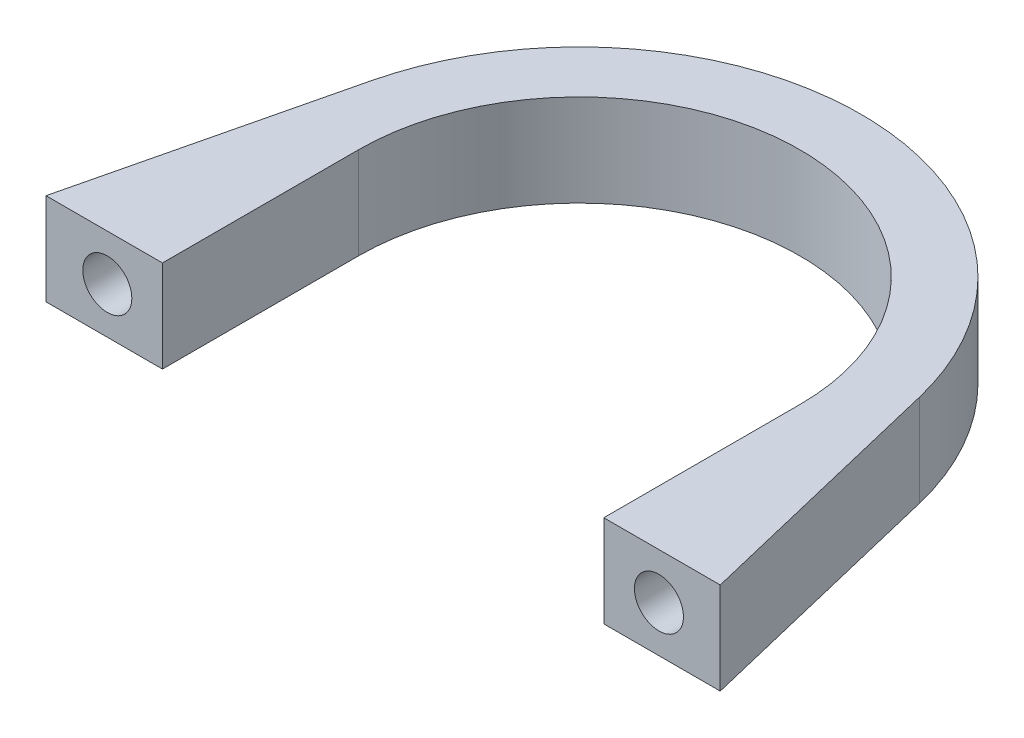
ISO-10303-21;
HEADER;
FILE_DESCRIPTION(('STEP AP214'),'2;1');
FILE_NAME('part.step','',(''),(''),'','','');
FILE_SCHEMA(('AUTOMOTIVE_DESIGN { 1 0 10303 214 1 1 1 1 }'));
ENDSEC;
DATA;
#1=APPLICATION_CONTEXT('core data for automotive mechanical design processes');
#2=APPLICATION_PROTOCOL_DEFINITION('international standard','automotive_design',2000,#1);
#3=PRODUCT_CONTEXT('',#1,'mechanical');
#4=PRODUCT('Part','Part','',(#3));
#5=PRODUCT_RELATED_PRODUCT_CATEGORY('part','',(#4));
#6=PRODUCT_DEFINITION_FORMATION('','',#4);
#7=PRODUCT_DEFINITION_CONTEXT('part definition',#1,'design');
#8=PRODUCT_DEFINITION('design','',#6,#7);
#9=PRODUCT_DEFINITION_SHAPE('','',#8);
#10=(LENGTH_UNIT() NAMED_UNIT(*) SI_UNIT(.MILLI.,.METRE.));
#11=(NAMED_UNIT(*) PLANE_ANGLE_UNIT() SI_UNIT($,.RADIAN.));
#12=(NAMED_UNIT(*) SI_UNIT($,.STERADIAN.) SOLID_ANGLE_UNIT());
#13=UNCERTAINTY_MEASURE_WITH_UNIT(LENGTH_MEASURE(1.E-05),#10,'distance_accuracy_value','');
#14=(GEOMETRIC_REPRESENTATION_CONTEXT(3) GLOBAL_UNCERTAINTY_ASSIGNED_CONTEXT((#13)) GLOBAL_UNIT_ASSIGNED_CONTEXT((#10,
#11,#12)) REPRESENTATION_CONTEXT('',''));
#15=CARTESIAN_POINT('',(0.,0.,0.));
#16=DIRECTION('',(0.,0.,1.));
#17=DIRECTION('',(1.,0.,0.));
#18=AXIS2_PLACEMENT_3D('',#15,#16,#17);
#19=CARTESIAN_POINT('',(-27.5,7.5,16.));
#20=DIRECTION('',(0.,0.,-1.));
#21=DIRECTION('',(-1.,0.,0.));
#22=AXIS2_PLACEMENT_3D('',#19,#20,#21);
#23=PLANE('',#22);
#24=CARTESIAN_POINT('',(-22.5,3.75,16.));
#25=DIRECTION('',(0.,0.,1.));
#26=DIRECTION('',(1.,0.,0.));
#27=AXIS2_PLACEMENT_3D('',#24,#25,#26);
#28=CIRCLE('',#27,2.);
#29=CARTESIAN_POINT('',(-20.5,3.75,16.));
#30=VERTEX_POINT('',#29);
#31=EDGE_CURVE('E221',#30,#30,#28,.T.);
#32=ORIENTED_EDGE('',*,*,#31,.F.);
#33=EDGE_LOOP('',(#32));
#34=FACE_BOUND('',#33,.T.);
#35=DIRECTION('',(1.,0.,0.));
#36=VECTOR('',#35,1.);
#37=CARTESIAN_POINT('',(-27.5,0.,16.));
#38=LINE('',#37,#36);
#39=CARTESIAN_POINT('',(-27.5,0.,16.));
#40=VERTEX_POINT('',#39);
#41=CARTESIAN_POINT('',(-18.,0.,16.));
#42=VERTEX_POINT('',#41);
#43=EDGE_CURVE('E146',#40,#42,#38,.T.);
#44=ORIENTED_EDGE('',*,*,#43,.T.);
#45=DIRECTION('',(0.,-1.,0.));
#46=VECTOR('',#45,1.);
#47=CARTESIAN_POINT('',(-18.,7.5,16.));
#48=LINE('',#47,#46);
#49=CARTESIAN_POINT('',(-18.,7.5,16.));
#50=VERTEX_POINT('',#49);
#51=EDGE_CURVE('E11',#50,#42,#48,.T.);
#52=ORIENTED_EDGE('',*,*,#51,.F.);
#53=DIRECTION('',(1.,0.,0.));
#54=VECTOR('',#53,1.);
#55=CARTESIAN_POINT('',(-27.5,7.5,16.));
#56=LINE('',#55,#54);
#57=CARTESIAN_POINT('',(-27.5,7.5,16.));
#58=VERTEX_POINT('',#57);
#59=EDGE_CURVE('E169',#58,#50,#56,.T.);
#60=ORIENTED_EDGE('',*,*,#59,.F.);
#61=DIRECTION('',(0.,-1.,0.));
#62=VECTOR('',#61,1.);
#63=CARTESIAN_POINT('',(-27.5,7.5,16.));
#64=LINE('',#63,#62);
#65=EDGE_CURVE('E142',#58,#40,#64,.T.);
#66=ORIENTED_EDGE('',*,*,#65,.T.);
#67=EDGE_LOOP('',(#44,#52,#60,#66));
#68=FACE_BOUND('',#67,.T.);
#69=ADVANCED_FACE('F45',(#34,#68),#23,.F.);
#70=CARTESIAN_POINT('',(-18.,7.5,16.));
#71=DIRECTION('',(-1.,0.,0.));
#72=DIRECTION('',(0.,0.,1.));
#73=AXIS2_PLACEMENT_3D('',#70,#71,#72);
#74=PLANE('',#73);
#75=DIRECTION('',(0.,0.,-1.));
#76=VECTOR('',#75,1.);
#77=CARTESIAN_POINT('',(-18.,0.,16.));
#78=LINE('',#77,#76);
#79=CARTESIAN_POINT('',(-18.,0.,0.));
#80=VERTEX_POINT('',#79);
#81=EDGE_CURVE('E150',#42,#80,#78,.T.);
#82=ORIENTED_EDGE('',*,*,#81,.T.);
#83=DIRECTION('',(0.,-1.,0.));
#84=VECTOR('',#83,1.);
#85=CARTESIAN_POINT('',(-18.,7.5,0.));
#86=LINE('',#85,#84);
#87=CARTESIAN_POINT('',(-18.,7.5,0.));
#88=VERTEX_POINT('',#87);
#89=EDGE_CURVE('E54',#88,#80,#86,.T.);
#90=ORIENTED_EDGE('',*,*,#89,.F.);
#91=DIRECTION('',(0.,0.,-1.));
#92=VECTOR('',#91,1.);
#93=CARTESIAN_POINT('',(-18.,7.5,16.));
#94=LINE('',#93,#92);
#95=EDGE_CURVE('E105',#50,#88,#94,.T.);
#96=ORIENTED_EDGE('',*,*,#95,.F.);
#97=ORIENTED_EDGE('',*,*,#51,.T.);
#98=EDGE_LOOP('',(#82,#90,#96,#97));
#99=FACE_BOUND('',#98,.T.);
#100=ADVANCED_FACE('F240',(#99),#74,.F.);
#101=CARTESIAN_POINT('',(0.,7.5,0.));
#102=DIRECTION('',(0.,-1.,0.));
#103=DIRECTION('',(0.,0.,-1.));
#104=AXIS2_PLACEMENT_3D('',#101,#102,#103);
#105=CYLINDRICAL_SURFACE('',#104,18.);
#106=CARTESIAN_POINT('',(0.,0.,0.));
#107=DIRECTION('',(0.,-1.,0.));
#108=DIRECTION('',(0.,0.,1.));
#109=AXIS2_PLACEMENT_3D('',#106,#107,#108);
#110=CIRCLE('',#109,18.);
#111=CARTESIAN_POINT('',(18.,0.,0.));
#112=VERTEX_POINT('',#111);
#113=EDGE_CURVE('E154',#80,#112,#110,.T.);
#114=ORIENTED_EDGE('',*,*,#113,.T.);
#115=DIRECTION('',(0.,-1.,0.));
#116=VECTOR('',#115,1.);
#117=CARTESIAN_POINT('',(18.,7.5,0.));
#118=LINE('',#117,#116);
#119=CARTESIAN_POINT('',(18.,7.5,0.));
#120=VERTEX_POINT('',#119);
#121=EDGE_CURVE('E180',#120,#112,#118,.T.);
#122=ORIENTED_EDGE('',*,*,#121,.F.);
#123=CARTESIAN_POINT('',(0.,7.5,0.));
#124=DIRECTION('',(0.,-1.,0.));
#125=DIRECTION('',(0.,0.,1.));
#126=AXIS2_PLACEMENT_3D('',#123,#124,#125);
#127=CIRCLE('',#126,18.);
#128=EDGE_CURVE('E190',#88,#120,#127,.T.);
#129=ORIENTED_EDGE('',*,*,#128,.F.);
#130=ORIENTED_EDGE('',*,*,#89,.T.);
#131=EDGE_LOOP('',(#114,#122,#129,#130));
#132=FACE_BOUND('',#131,.T.);
#133=ADVANCED_FACE('F188',(#132),#105,.F.);
#134=CARTESIAN_POINT('',(18.,7.5,16.));
#135=DIRECTION('',(1.,0.,0.));
#136=DIRECTION('',(0.,0.,-1.));
#137=AXIS2_PLACEMENT_3D('',#134,#135,#136);
#138=PLANE('',#137);
#139=DIRECTION('',(0.,0.,1.));
#140=VECTOR('',#139,1.);
#141=CARTESIAN_POINT('',(18.,0.,16.));
#142=LINE('',#141,#140);
#143=CARTESIAN_POINT('',(18.,0.,16.));
#144=VERTEX_POINT('',#143);
#145=EDGE_CURVE('E157',#112,#144,#142,.T.);
#146=ORIENTED_EDGE('',*,*,#145,.T.);
#147=DIRECTION('',(0.,-1.,0.));
#148=VECTOR('',#147,1.);
#149=CARTESIAN_POINT('',(18.,7.5,16.));
#150=LINE('',#149,#148);
#151=CARTESIAN_POINT('',(18.,7.5,16.));
#152=VERTEX_POINT('',#151);
#153=EDGE_CURVE('E176',#152,#144,#150,.T.);
#154=ORIENTED_EDGE('',*,*,#153,.F.);
#155=DIRECTION('',(0.,0.,1.));
#156=VECTOR('',#155,1.);
#157=CARTESIAN_POINT('',(18.,7.5,16.));
#158=LINE('',#157,#156);
#159=EDGE_CURVE('E203',#120,#152,#158,.T.);
#160=ORIENTED_EDGE('',*,*,#159,.F.);
#161=ORIENTED_EDGE('',*,*,#121,.T.);
#162=EDGE_LOOP('',(#146,#154,#160,#161));
#163=FACE_BOUND('',#162,.T.);
#164=ADVANCED_FACE('F198',(#163),#138,.F.);
#165=CARTESIAN_POINT('',(27.5,7.5,16.));
#166=DIRECTION('',(0.,0.,-1.));
#167=DIRECTION('',(-1.,0.,0.));
#168=AXIS2_PLACEMENT_3D('',#165,#166,#167);
#169=PLANE('',#168);
#170=CARTESIAN_POINT('',(22.5,3.75,16.));
#171=DIRECTION('',(0.,0.,1.));
#172=DIRECTION('',(-1.,0.,0.));
#173=AXIS2_PLACEMENT_3D('',#170,#171,#172);
#174=CIRCLE('',#173,2.);
#175=CARTESIAN_POINT('',(20.5,3.75,16.));
#176=VERTEX_POINT('',#175);
#177=EDGE_CURVE('E217',#176,#176,#174,.T.);
#178=ORIENTED_EDGE('',*,*,#177,.F.);
#179=EDGE_LOOP('',(#178));
#180=FACE_BOUND('',#179,.T.);
#181=DIRECTION('',(1.,0.,0.));
#182=VECTOR('',#181,1.);
#183=CARTESIAN_POINT('',(27.5,0.,16.));
#184=LINE('',#183,#182);
#185=CARTESIAN_POINT('',(27.5,0.,16.));
#186=VERTEX_POINT('',#185);
#187=EDGE_CURVE('E160',#144,#186,#184,.T.);
#188=ORIENTED_EDGE('',*,*,#187,.T.);
#189=DIRECTION('',(0.,-1.,0.));
#190=VECTOR('',#189,1.);
#191=CARTESIAN_POINT('',(27.5,7.5,16.));
#192=LINE('',#191,#190);
#193=CARTESIAN_POINT('',(27.5,7.5,16.));
#194=VERTEX_POINT('',#193);
#195=EDGE_CURVE('E135',#194,#186,#192,.T.);
#196=ORIENTED_EDGE('',*,*,#195,.F.);
#197=DIRECTION('',(1.,0.,0.));
#198=VECTOR('',#197,1.);
#199=CARTESIAN_POINT('',(27.5,7.5,16.));
#200=LINE('',#199,#198);
#201=EDGE_CURVE('E124',#152,#194,#200,.T.);
#202=ORIENTED_EDGE('',*,*,#201,.F.);
#203=ORIENTED_EDGE('',*,*,#153,.T.);
#204=EDGE_LOOP('',(#188,#196,#202,#203));
#205=FACE_BOUND('',#204,.T.);
#206=ADVANCED_FACE('F201',(#180,#205),#169,.F.);
#207=CARTESIAN_POINT('',(22.3632747254224,7.5,-5.37437843431982));
#208=DIRECTION('',(-0.972316292409671,0.,0.233668627579122));
#209=DIRECTION('',(0.233668627579122,0.,0.972316292409671));
#210=AXIS2_PLACEMENT_3D('',#207,#208,#209);
#211=PLANE('',#210);
#212=DIRECTION('',(-0.233668627579122,0.,-0.972316292409671));
#213=VECTOR('',#212,1.);
#214=CARTESIAN_POINT('',(22.3632747254224,0.,-5.37437843431982));
#215=LINE('',#214,#213);
#216=CARTESIAN_POINT('',(22.3632747254224,0.,-5.37437843431982));
#217=VERTEX_POINT('',#216);
#218=EDGE_CURVE('E133',#186,#217,#215,.T.);
#219=ORIENTED_EDGE('',*,*,#218,.T.);
#220=DIRECTION('',(0.,-1.,0.));
#221=VECTOR('',#220,1.);
#222=CARTESIAN_POINT('',(22.3632747254224,7.5,-5.37437843431982));
#223=LINE('',#222,#221);
#224=CARTESIAN_POINT('',(22.3632747254224,7.5,-5.37437843431982));
#225=VERTEX_POINT('',#224);
#226=EDGE_CURVE('E130',#225,#217,#223,.T.);
#227=ORIENTED_EDGE('',*,*,#226,.F.);
#228=DIRECTION('',(-0.233668627579122,0.,-0.972316292409671));
#229=VECTOR('',#228,1.);
#230=CARTESIAN_POINT('',(22.3632747254224,7.5,-5.37437843431982));
#231=LINE('',#230,#229);
#232=EDGE_CURVE('E118',#194,#225,#231,.T.);
#233=ORIENTED_EDGE('',*,*,#232,.F.);
#234=ORIENTED_EDGE('',*,*,#195,.T.);
#235=EDGE_LOOP('',(#219,#227,#233,#234));
#236=FACE_BOUND('',#235,.T.);
#237=ADVANCED_FACE('F131',(#236),#211,.F.);
#238=CARTESIAN_POINT('',(0.,7.5,0.));
#239=DIRECTION('',(0.,-1.,0.));
#240=DIRECTION('',(0.,0.,-1.));
#241=AXIS2_PLACEMENT_3D('',#238,#239,#240);
#242=CYLINDRICAL_SURFACE('',#241,23.);
#243=CARTESIAN_POINT('',(0.,0.,0.));
#244=DIRECTION('',(0.,1.,0.));
#245=DIRECTION('',(0.,0.,1.));
#246=AXIS2_PLACEMENT_3D('',#243,#244,#245);
#247=CIRCLE('',#246,23.);
#248=CARTESIAN_POINT('',(-22.3632747254224,0.,-5.37437843431982));
#249=VERTEX_POINT('',#248);
#250=EDGE_CURVE('E91',#217,#249,#247,.T.);
#251=ORIENTED_EDGE('',*,*,#250,.T.);
#252=DIRECTION('',(0.,-1.,0.));
#253=VECTOR('',#252,1.);
#254=CARTESIAN_POINT('',(-22.3632747254224,7.5,-5.37437843431982));
#255=LINE('',#254,#253);
#256=CARTESIAN_POINT('',(-22.3632747254224,7.5,-5.37437843431982));
#257=VERTEX_POINT('',#256);
#258=EDGE_CURVE('E136',#257,#249,#255,.T.);
#259=ORIENTED_EDGE('',*,*,#258,.F.);
#260=CARTESIAN_POINT('',(0.,7.5,0.));
#261=DIRECTION('',(0.,1.,0.));
#262=DIRECTION('',(0.,0.,1.));
#263=AXIS2_PLACEMENT_3D('',#260,#261,#262);
#264=CIRCLE('',#263,23.);
#265=EDGE_CURVE('E122',#225,#257,#264,.T.);
#266=ORIENTED_EDGE('',*,*,#265,.F.);
#267=ORIENTED_EDGE('',*,*,#226,.T.);
#268=EDGE_LOOP('',(#251,#259,#266,#267));
#269=FACE_BOUND('',#268,.T.);
#270=ADVANCED_FACE('F138',(#269),#242,.T.);
#271=CARTESIAN_POINT('',(-22.3632747254224,7.5,-5.37437843431982));
#272=DIRECTION('',(0.972316292409671,0.,0.233668627579122));
#273=DIRECTION('',(0.233668627579122,0.,-0.972316292409671));
#274=AXIS2_PLACEMENT_3D('',#271,#272,#273);
#275=PLANE('',#274);
#276=DIRECTION('',(-0.233668627579122,0.,0.972316292409671));
#277=VECTOR('',#276,1.);
#278=CARTESIAN_POINT('',(-22.3632747254224,0.,-5.37437843431982));
#279=LINE('',#278,#277);
#280=EDGE_CURVE('E97',#249,#40,#279,.T.);
#281=ORIENTED_EDGE('',*,*,#280,.T.);
#282=ORIENTED_EDGE('',*,*,#65,.F.);
#283=DIRECTION('',(-0.233668627579122,0.,0.972316292409671));
#284=VECTOR('',#283,1.);
#285=CARTESIAN_POINT('',(-22.3632747254224,7.5,-5.37437843431982));
#286=LINE('',#285,#284);
#287=EDGE_CURVE('E62',#257,#58,#286,.T.);
#288=ORIENTED_EDGE('',*,*,#287,.F.);
#289=ORIENTED_EDGE('',*,*,#258,.T.);
#290=EDGE_LOOP('',(#281,#282,#288,#289));
#291=FACE_BOUND('',#290,.T.);
#292=ADVANCED_FACE('F243',(#291),#275,.F.);
#293=CARTESIAN_POINT('',(0.,7.5,0.));
#294=DIRECTION('',(0.,1.,0.));
#295=DIRECTION('',(0.,0.,1.));
#296=AXIS2_PLACEMENT_3D('',#293,#294,#295);
#297=PLANE('',#296);
#298=ORIENTED_EDGE('',*,*,#59,.T.);
#299=ORIENTED_EDGE('',*,*,#95,.T.);
#300=ORIENTED_EDGE('',*,*,#128,.T.);
#301=ORIENTED_EDGE('',*,*,#159,.T.);
#302=ORIENTED_EDGE('',*,*,#201,.T.);
#303=ORIENTED_EDGE('',*,*,#232,.T.);
#304=ORIENTED_EDGE('',*,*,#265,.T.);
#305=ORIENTED_EDGE('',*,*,#287,.T.);
#306=EDGE_LOOP('',(#298,#299,#300,#301,#302,#303,#304,#305));
#307=FACE_BOUND('',#306,.T.);
#308=ADVANCED_FACE('F120',(#307),#297,.T.);
#309=CARTESIAN_POINT('',(0.,0.,0.));
#310=DIRECTION('',(0.,1.,0.));
#311=DIRECTION('',(0.,0.,1.));
#312=AXIS2_PLACEMENT_3D('',#309,#310,#311);
#313=PLANE('',#312);
#314=ORIENTED_EDGE('',*,*,#43,.F.);
#315=ORIENTED_EDGE('',*,*,#280,.F.);
#316=ORIENTED_EDGE('',*,*,#250,.F.);
#317=ORIENTED_EDGE('',*,*,#218,.F.);
#318=ORIENTED_EDGE('',*,*,#187,.F.);
#319=ORIENTED_EDGE('',*,*,#145,.F.);
#320=ORIENTED_EDGE('',*,*,#113,.F.);
#321=ORIENTED_EDGE('',*,*,#81,.F.);
#322=EDGE_LOOP('',(#314,#315,#316,#317,#318,#319,#320,#321));
#323=FACE_BOUND('',#322,.T.);
#324=ADVANCED_FACE('F194',(#323),#313,.F.);
#325=CARTESIAN_POINT('',(22.5,3.75,12.));
#326=DIRECTION('',(0.,0.,1.));
#327=DIRECTION('',(1.,0.,0.));
#328=AXIS2_PLACEMENT_3D('',#325,#326,#327);
#329=CYLINDRICAL_SURFACE('',#328,2.);
#330=CARTESIAN_POINT('',(22.5,3.75,12.));
#331=DIRECTION('',(0.,0.,1.));
#332=DIRECTION('',(-1.,0.,0.));
#333=AXIS2_PLACEMENT_3D('',#330,#331,#332);
#334=CIRCLE('',#333,2.);
#335=CARTESIAN_POINT('',(20.5,3.75,12.));
#336=VERTEX_POINT('',#335);
#337=EDGE_CURVE('E213',#336,#336,#334,.T.);
#338=ORIENTED_EDGE('',*,*,#337,.F.);
#339=EDGE_LOOP('',(#338));
#340=FACE_BOUND('',#339,.T.);
#341=ORIENTED_EDGE('',*,*,#177,.T.);
#342=EDGE_LOOP('',(#341));
#343=FACE_BOUND('',#342,.T.);
#344=ADVANCED_FACE('F307',(#340,#343),#329,.F.);
#345=CARTESIAN_POINT('',(22.5,3.75,12.));
#346=DIRECTION('',(0.,0.,-1.));
#347=DIRECTION('',(-1.,0.,0.));
#348=AXIS2_PLACEMENT_3D('',#345,#346,#347);
#349=PLANE('',#348);
#350=ORIENTED_EDGE('',*,*,#337,.T.);
#351=EDGE_LOOP('',(#350));
#352=FACE_BOUND('',#351,.T.);
#353=ADVANCED_FACE('F234',(#352),#349,.F.);
#354=CARTESIAN_POINT('',(-22.5,3.75,12.));
#355=DIRECTION('',(0.,0.,1.));
#356=DIRECTION('',(1.,0.,0.));
#357=AXIS2_PLACEMENT_3D('',#354,#355,#356);
#358=CYLINDRICAL_SURFACE('',#357,2.);
#359=CARTESIAN_POINT('',(-22.5,3.75,12.));
#360=DIRECTION('',(0.,0.,1.));
#361=DIRECTION('',(1.,0.,0.));
#362=AXIS2_PLACEMENT_3D('',#359,#360,#361);
#363=CIRCLE('',#362,2.);
#364=CARTESIAN_POINT('',(-20.5,3.75,12.));
#365=VERTEX_POINT('',#364);
#366=EDGE_CURVE('E151',#365,#365,#363,.T.);
#367=ORIENTED_EDGE('',*,*,#366,.F.);
#368=EDGE_LOOP('',(#367));
#369=FACE_BOUND('',#368,.T.);
#370=ORIENTED_EDGE('',*,*,#31,.T.);
#371=EDGE_LOOP('',(#370));
#372=FACE_BOUND('',#371,.T.);
#373=ADVANCED_FACE('F231',(#369,#372),#358,.F.);
#374=CARTESIAN_POINT('',(-22.5,3.75,12.));
#375=DIRECTION('',(0.,0.,1.));
#376=DIRECTION('',(1.,0.,0.));
#377=AXIS2_PLACEMENT_3D('',#374,#375,#376);
#378=PLANE('',#377);
#379=ORIENTED_EDGE('',*,*,#366,.T.);
#380=EDGE_LOOP('',(#379));
#381=FACE_BOUND('',#380,.T.);
#382=ADVANCED_FACE('F229',(#381),#378,.T.);
#383=CLOSED_SHELL('',(#69,#100,#133,#164,#206,#237,#270,#292,#308,#324,#344,#353,#373,#382));
#384=MANIFOLD_SOLID_BREP('B2',#383);
#385=ADVANCED_BREP_SHAPE_REPRESENTATION('',(#18,#384),#14);
#386=SHAPE_DEFINITION_REPRESENTATION(#9,#385);
ENDSEC;
END-ISO-10303-21;
